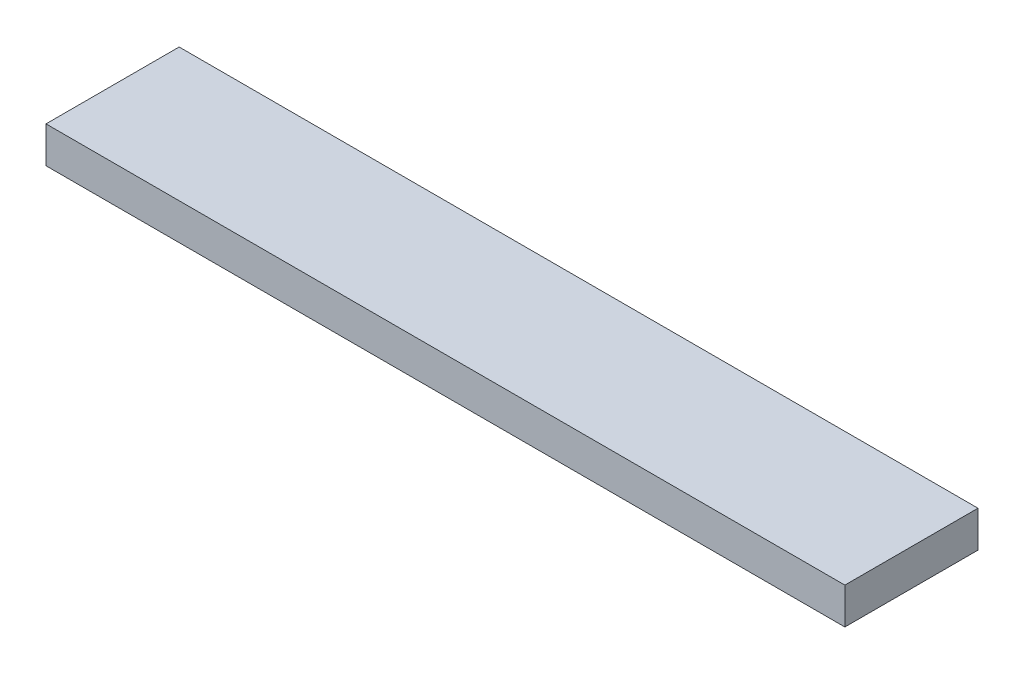
ISO-10303-21;
HEADER;
FILE_DESCRIPTION(('STEP AP214'),'2;1');
FILE_NAME('part.step','',(''),(''),'','','');
FILE_SCHEMA(('AUTOMOTIVE_DESIGN { 1 0 10303 214 1 1 1 1 }'));
ENDSEC;
DATA;
#1=APPLICATION_CONTEXT('core data for automotive mechanical design processes');
#2=APPLICATION_PROTOCOL_DEFINITION('international standard','automotive_design',2000,#1);
#3=PRODUCT_CONTEXT('',#1,'mechanical');
#4=PRODUCT('Part','Part','',(#3));
#5=PRODUCT_RELATED_PRODUCT_CATEGORY('part','',(#4));
#6=PRODUCT_DEFINITION_FORMATION('','',#4);
#7=PRODUCT_DEFINITION_CONTEXT('part definition',#1,'design');
#8=PRODUCT_DEFINITION('design','',#6,#7);
#9=PRODUCT_DEFINITION_SHAPE('','',#8);
#10=(LENGTH_UNIT() NAMED_UNIT(*) SI_UNIT(.MILLI.,.METRE.));
#11=(NAMED_UNIT(*) PLANE_ANGLE_UNIT() SI_UNIT($,.RADIAN.));
#12=(NAMED_UNIT(*) SI_UNIT($,.STERADIAN.) SOLID_ANGLE_UNIT());
#13=UNCERTAINTY_MEASURE_WITH_UNIT(LENGTH_MEASURE(1.E-05),#10,'distance_accuracy_value','');
#14=(GEOMETRIC_REPRESENTATION_CONTEXT(3) GLOBAL_UNCERTAINTY_ASSIGNED_CONTEXT((#13)) GLOBAL_UNIT_ASSIGNED_CONTEXT((#10,
#11,#12)) REPRESENTATION_CONTEXT('',''));
#15=CARTESIAN_POINT('',(0.,0.,0.));
#16=DIRECTION('',(0.,0.,1.));
#17=DIRECTION('',(1.,0.,0.));
#18=AXIS2_PLACEMENT_3D('',#15,#16,#17);
#19=CARTESIAN_POINT('',(0.,38.1,0.));
#20=DIRECTION('',(1.,0.,0.));
#21=DIRECTION('',(0.,0.,-1.));
#22=AXIS2_PLACEMENT_3D('',#19,#20,#21);
#23=PLANE('',#22);
#24=DIRECTION('',(0.,0.,1.));
#25=VECTOR('',#24,1.);
#26=CARTESIAN_POINT('',(0.,0.,0.));
#27=LINE('',#26,#25);
#28=CARTESIAN_POINT('',(0.,0.,-139.7));
#29=VERTEX_POINT('',#28);
#30=CARTESIAN_POINT('',(0.,0.,0.));
#31=VERTEX_POINT('',#30);
#32=EDGE_CURVE('E94',#29,#31,#27,.T.);
#33=ORIENTED_EDGE('',*,*,#32,.T.);
#34=DIRECTION('',(0.,-1.,0.));
#35=VECTOR('',#34,1.);
#36=CARTESIAN_POINT('',(0.,38.1,0.));
#37=LINE('',#36,#35);
#38=CARTESIAN_POINT('',(0.,38.1,0.));
#39=VERTEX_POINT('',#38);
#40=EDGE_CURVE('E11',#39,#31,#37,.T.);
#41=ORIENTED_EDGE('',*,*,#40,.F.);
#42=DIRECTION('',(0.,0.,1.));
#43=VECTOR('',#42,1.);
#44=CARTESIAN_POINT('',(0.,38.1,0.));
#45=LINE('',#44,#43);
#46=CARTESIAN_POINT('',(0.,38.1,-139.7));
#47=VERTEX_POINT('',#46);
#48=EDGE_CURVE('E82',#47,#39,#45,.T.);
#49=ORIENTED_EDGE('',*,*,#48,.F.);
#50=DIRECTION('',(0.,-1.,0.));
#51=VECTOR('',#50,1.);
#52=CARTESIAN_POINT('',(0.,38.1,-139.7));
#53=LINE('',#52,#51);
#54=EDGE_CURVE('E90',#47,#29,#53,.T.);
#55=ORIENTED_EDGE('',*,*,#54,.T.);
#56=EDGE_LOOP('',(#33,#41,#49,#55));
#57=FACE_BOUND('',#56,.T.);
#58=ADVANCED_FACE('F31',(#57),#23,.F.);
#59=CARTESIAN_POINT('',(0.,38.1,0.));
#60=DIRECTION('',(0.,0.,-1.));
#61=DIRECTION('',(-1.,0.,0.));
#62=AXIS2_PLACEMENT_3D('',#59,#60,#61);
#63=PLANE('',#62);
#64=DIRECTION('',(1.,0.,0.));
#65=VECTOR('',#64,1.);
#66=CARTESIAN_POINT('',(0.,0.,0.));
#67=LINE('',#66,#65);
#68=CARTESIAN_POINT('',(838.2,0.,0.));
#69=VERTEX_POINT('',#68);
#70=EDGE_CURVE('E86',#31,#69,#67,.T.);
#71=ORIENTED_EDGE('',*,*,#70,.T.);
#72=DIRECTION('',(0.,-1.,0.));
#73=VECTOR('',#72,1.);
#74=CARTESIAN_POINT('',(838.2,38.1,0.));
#75=LINE('',#74,#73);
#76=CARTESIAN_POINT('',(838.2,38.1,0.));
#77=VERTEX_POINT('',#76);
#78=EDGE_CURVE('E39',#77,#69,#75,.T.);
#79=ORIENTED_EDGE('',*,*,#78,.F.);
#80=DIRECTION('',(1.,0.,0.));
#81=VECTOR('',#80,1.);
#82=CARTESIAN_POINT('',(0.,38.1,0.));
#83=LINE('',#82,#81);
#84=EDGE_CURVE('E77',#39,#77,#83,.T.);
#85=ORIENTED_EDGE('',*,*,#84,.F.);
#86=ORIENTED_EDGE('',*,*,#40,.T.);
#87=EDGE_LOOP('',(#71,#79,#85,#86));
#88=FACE_BOUND('',#87,.T.);
#89=ADVANCED_FACE('F85',(#88),#63,.F.);
#90=CARTESIAN_POINT('',(838.2,38.1,0.));
#91=DIRECTION('',(-1.,0.,0.));
#92=DIRECTION('',(0.,0.,1.));
#93=AXIS2_PLACEMENT_3D('',#90,#91,#92);
#94=PLANE('',#93);
#95=DIRECTION('',(0.,0.,-1.));
#96=VECTOR('',#95,1.);
#97=CARTESIAN_POINT('',(838.2,0.,0.));
#98=LINE('',#97,#96);
#99=CARTESIAN_POINT('',(838.2,0.,-139.7));
#100=VERTEX_POINT('',#99);
#101=EDGE_CURVE('E64',#69,#100,#98,.T.);
#102=ORIENTED_EDGE('',*,*,#101,.T.);
#103=DIRECTION('',(0.,-1.,0.));
#104=VECTOR('',#103,1.);
#105=CARTESIAN_POINT('',(838.2,38.1,-139.7));
#106=LINE('',#105,#104);
#107=CARTESIAN_POINT('',(838.2,38.1,-139.7));
#108=VERTEX_POINT('',#107);
#109=EDGE_CURVE('E87',#108,#100,#106,.T.);
#110=ORIENTED_EDGE('',*,*,#109,.F.);
#111=DIRECTION('',(0.,0.,-1.));
#112=VECTOR('',#111,1.);
#113=CARTESIAN_POINT('',(838.2,38.1,0.));
#114=LINE('',#113,#112);
#115=EDGE_CURVE('E80',#77,#108,#114,.T.);
#116=ORIENTED_EDGE('',*,*,#115,.F.);
#117=ORIENTED_EDGE('',*,*,#78,.T.);
#118=EDGE_LOOP('',(#102,#110,#116,#117));
#119=FACE_BOUND('',#118,.T.);
#120=ADVANCED_FACE('F88',(#119),#94,.F.);
#121=CARTESIAN_POINT('',(0.,38.1,-139.7));
#122=DIRECTION('',(0.,0.,1.));
#123=DIRECTION('',(1.,0.,0.));
#124=AXIS2_PLACEMENT_3D('',#121,#122,#123);
#125=PLANE('',#124);
#126=DIRECTION('',(-1.,0.,0.));
#127=VECTOR('',#126,1.);
#128=CARTESIAN_POINT('',(0.,0.,-139.7));
#129=LINE('',#128,#127);
#130=EDGE_CURVE('E70',#100,#29,#129,.T.);
#131=ORIENTED_EDGE('',*,*,#130,.T.);
#132=ORIENTED_EDGE('',*,*,#54,.F.);
#133=DIRECTION('',(-1.,0.,0.));
#134=VECTOR('',#133,1.);
#135=CARTESIAN_POINT('',(0.,38.1,-139.7));
#136=LINE('',#135,#134);
#137=EDGE_CURVE('E47',#108,#47,#136,.T.);
#138=ORIENTED_EDGE('',*,*,#137,.F.);
#139=ORIENTED_EDGE('',*,*,#109,.T.);
#140=EDGE_LOOP('',(#131,#132,#138,#139));
#141=FACE_BOUND('',#140,.T.);
#142=ADVANCED_FACE('F101',(#141),#125,.F.);
#143=CARTESIAN_POINT('',(0.,38.1,-139.7));
#144=DIRECTION('',(0.,-1.,0.));
#145=DIRECTION('',(0.,0.,-1.));
#146=AXIS2_PLACEMENT_3D('',#143,#144,#145);
#147=PLANE('',#146);
#148=ORIENTED_EDGE('',*,*,#48,.T.);
#149=ORIENTED_EDGE('',*,*,#84,.T.);
#150=ORIENTED_EDGE('',*,*,#115,.T.);
#151=ORIENTED_EDGE('',*,*,#137,.T.);
#152=EDGE_LOOP('',(#148,#149,#150,#151));
#153=FACE_BOUND('',#152,.T.);
#154=ADVANCED_FACE('F78',(#153),#147,.F.);
#155=CARTESIAN_POINT('',(0.,0.,-139.7));
#156=DIRECTION('',(0.,-1.,0.));
#157=DIRECTION('',(0.,0.,-1.));
#158=AXIS2_PLACEMENT_3D('',#155,#156,#157);
#159=PLANE('',#158);
#160=ORIENTED_EDGE('',*,*,#32,.F.);
#161=ORIENTED_EDGE('',*,*,#130,.F.);
#162=ORIENTED_EDGE('',*,*,#101,.F.);
#163=ORIENTED_EDGE('',*,*,#70,.F.);
#164=EDGE_LOOP('',(#160,#161,#162,#163));
#165=FACE_BOUND('',#164,.T.);
#166=ADVANCED_FACE('F104',(#165),#159,.T.);
#167=CLOSED_SHELL('',(#58,#89,#120,#142,#154,#166));
#168=MANIFOLD_SOLID_BREP('B2',#167);
#169=ADVANCED_BREP_SHAPE_REPRESENTATION('',(#18,#168),#14);
#170=SHAPE_DEFINITION_REPRESENTATION(#9,#169);
ENDSEC;
END-ISO-10303-21;
